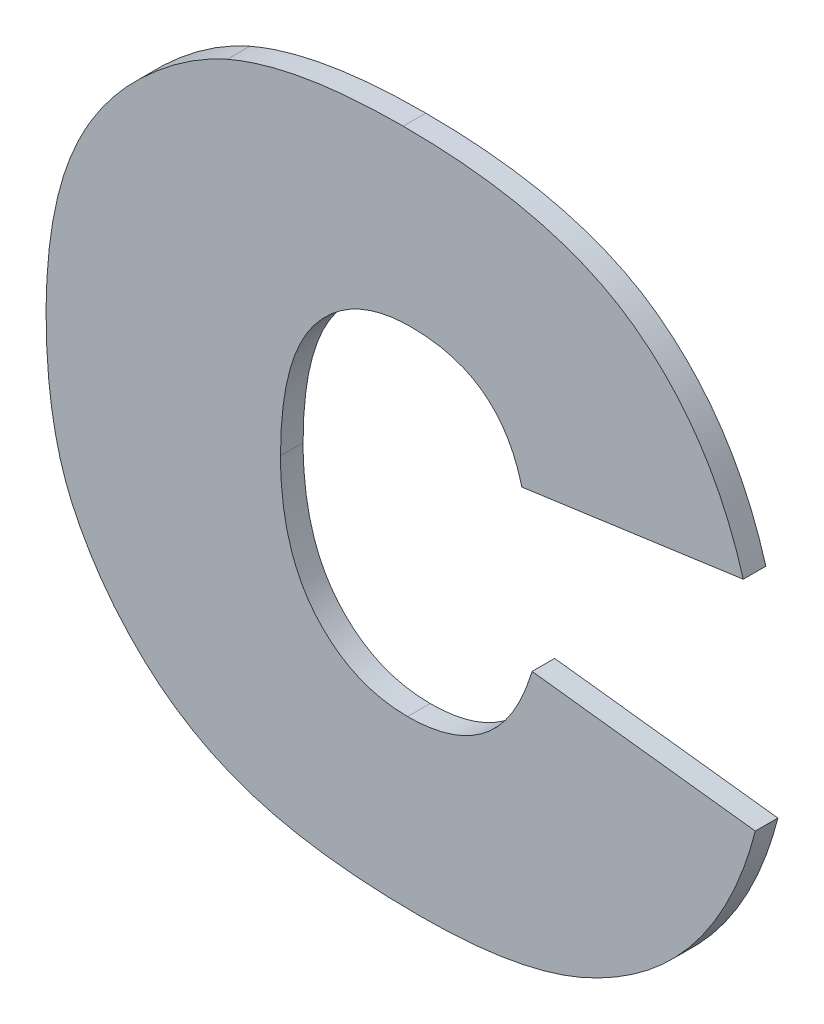
ISO-10303-21;
HEADER;
FILE_DESCRIPTION(('STEP AP214'),'2;1');
FILE_NAME('part.step','',(''),(''),'','','');
FILE_SCHEMA(('AUTOMOTIVE_DESIGN { 1 0 10303 214 1 1 1 1 }'));
ENDSEC;
DATA;
#1=APPLICATION_CONTEXT('core data for automotive mechanical design processes');
#2=APPLICATION_PROTOCOL_DEFINITION('international standard','automotive_design',2000,#1);
#3=PRODUCT_CONTEXT('',#1,'mechanical');
#4=PRODUCT('Part','Part','',(#3));
#5=PRODUCT_RELATED_PRODUCT_CATEGORY('part','',(#4));
#6=PRODUCT_DEFINITION_FORMATION('','',#4);
#7=PRODUCT_DEFINITION_CONTEXT('part definition',#1,'design');
#8=PRODUCT_DEFINITION('design','',#6,#7);
#9=PRODUCT_DEFINITION_SHAPE('','',#8);
#10=(LENGTH_UNIT() NAMED_UNIT(*) SI_UNIT(.MILLI.,.METRE.));
#11=(NAMED_UNIT(*) PLANE_ANGLE_UNIT() SI_UNIT($,.RADIAN.));
#12=(NAMED_UNIT(*) SI_UNIT($,.STERADIAN.) SOLID_ANGLE_UNIT());
#13=UNCERTAINTY_MEASURE_WITH_UNIT(LENGTH_MEASURE(1.E-05),#10,'distance_accuracy_value','');
#14=(GEOMETRIC_REPRESENTATION_CONTEXT(3) GLOBAL_UNCERTAINTY_ASSIGNED_CONTEXT((#13)) GLOBAL_UNIT_ASSIGNED_CONTEXT((#10,
#11,#12)) REPRESENTATION_CONTEXT('',''));
#15=CARTESIAN_POINT('',(0.,0.,0.));
#16=DIRECTION('',(0.,0.,1.));
#17=DIRECTION('',(1.,0.,0.));
#18=AXIS2_PLACEMENT_3D('',#15,#16,#17);
#19=CARTESIAN_POINT('',(1.0252863999862,-0.680804123163525,0.));
#20=CARTESIAN_POINT('',(1.0252863999862,-0.680804123163525,0.003));
#21=CARTESIAN_POINT('',(1.025286385339,-0.66893671234038,0.));
#22=CARTESIAN_POINT('',(1.025286385339,-0.66893671234038,0.003));
#23=CARTESIAN_POINT('',(1.0348715874076,-0.657297509125677,0.));
#24=CARTESIAN_POINT('',(1.0348715874076,-0.657297509125677,0.003));
#25=CARTESIAN_POINT('',(1.0426310773432,-0.657297520956087,0.));
#26=CARTESIAN_POINT('',(1.0426310773432,-0.657297520956087,0.003));
#27=B_SPLINE_SURFACE_WITH_KNOTS('',2,1,((#19,#20),(#21,#22),(#23,#24),(#25,#26)),.UNSPECIFIED.,
.F.,.F.,.F.,(3,1,3),(2,2),(-2.,-1.,0.),(0.,0.0003),.UNSPECIFIED.);
#28=CARTESIAN_POINT('',(1.0252863999862,-0.680804123163525,0.));
#29=CARTESIAN_POINT('',(1.025286385339,-0.66893671234038,0.));
#30=CARTESIAN_POINT('',(1.0348715874076,-0.657297509125677,0.));
#31=CARTESIAN_POINT('',(1.0426310773432,-0.657297520956087,0.));
#32=B_SPLINE_CURVE_WITH_KNOTS('',2,(#28,#29,#30,#31),.UNSPECIFIED.,.F.,.F.,(3,1,3),(-2.,-1.,0.),.UNSPECIFIED.);
#33=CARTESIAN_POINT('',(1.0252863999862,-0.680804123163525,0.));
#34=VERTEX_POINT('',#33);
#35=CARTESIAN_POINT('',(1.0426310773432,-0.657297520956087,0.));
#36=VERTEX_POINT('',#35);
#37=EDGE_CURVE('E11',#34,#36,#32,.T.);
#38=DIRECTION('',(0.,0.,1.));
#39=VECTOR('',#38,1.);
#40=CARTESIAN_POINT('',(1.0426310773432,-0.657297520956087,0.));
#41=LINE('',#40,#39);
#42=CARTESIAN_POINT('',(1.0426310773432,-0.657297520956087,0.003));
#43=VERTEX_POINT('',#42);
#44=EDGE_CURVE('E28',#36,#43,#41,.T.);
#45=CARTESIAN_POINT('',(1.0252863999862,-0.680804123163525,0.003));
#46=CARTESIAN_POINT('',(1.025286385339,-0.66893671234038,0.003));
#47=CARTESIAN_POINT('',(1.0348715874076,-0.657297509125677,0.003));
#48=CARTESIAN_POINT('',(1.0426310773432,-0.657297520956087,0.003));
#49=B_SPLINE_CURVE_WITH_KNOTS('',2,(#45,#46,#47,#48),.UNSPECIFIED.,.F.,.F.,(3,1,3),(-2.,-1.,0.),.UNSPECIFIED.);
#50=CARTESIAN_POINT('',(1.0252863999862,-0.680804123163525,0.003));
#51=VERTEX_POINT('',#50);
#52=EDGE_CURVE('E128',#51,#43,#49,.T.);
#53=DIRECTION('',(0.,0.,1.));
#54=VECTOR('',#53,1.);
#55=CARTESIAN_POINT('',(1.0252863999862,-0.680804123163525,0.));
#56=LINE('',#55,#54);
#57=EDGE_CURVE('E297',#34,#51,#56,.T.);
#58=ORIENTED_EDGE('',*,*,#37,.T.);
#59=ORIENTED_EDGE('',*,*,#44,.T.);
#60=ORIENTED_EDGE('',*,*,#52,.F.);
#61=ORIENTED_EDGE('',*,*,#57,.F.);
#62=EDGE_LOOP('',(#58,#59,#60,#61));
#63=FACE_BOUND('',#62,.T.);
#64=ADVANCED_FACE('F17',(#63),#27,.T.);
#65=CARTESIAN_POINT('',(1.0421746384654,-0.702370860140251,0.));
#66=CARTESIAN_POINT('',(1.0421746384654,-0.702370860140251,0.003));
#67=CARTESIAN_POINT('',(1.0347575067009,-0.702370873227862,0.));
#68=CARTESIAN_POINT('',(1.0347575067009,-0.702370873227862,0.003));
#69=CARTESIAN_POINT('',(1.0252863806569,-0.691416356872166,0.));
#70=CARTESIAN_POINT('',(1.0252863806569,-0.691416356872166,0.003));
#71=CARTESIAN_POINT('',(1.0252863999862,-0.680804123163525,0.));
#72=CARTESIAN_POINT('',(1.0252863999862,-0.680804123163525,0.003));
#73=B_SPLINE_SURFACE_WITH_KNOTS('',2,1,((#65,#66),(#67,#68),(#69,#70),(#71,#72)),.UNSPECIFIED.,
.F.,.F.,.F.,(3,1,3),(2,2),(-2.,-1.,0.),(0.,0.0003),.UNSPECIFIED.);
#74=CARTESIAN_POINT('',(1.0421746384654,-0.702370860140251,0.));
#75=CARTESIAN_POINT('',(1.0347575067009,-0.702370873227862,0.));
#76=CARTESIAN_POINT('',(1.0252863806569,-0.691416356872166,0.));
#77=CARTESIAN_POINT('',(1.0252863999862,-0.680804123163525,0.));
#78=B_SPLINE_CURVE_WITH_KNOTS('',2,(#74,#75,#76,#77),.UNSPECIFIED.,.F.,.F.,(3,1,3),(-2.,-1.,0.),.UNSPECIFIED.);
#79=CARTESIAN_POINT('',(1.0421746384654,-0.702370860140251,0.));
#80=VERTEX_POINT('',#79);
#81=EDGE_CURVE('E289',#80,#34,#78,.T.);
#82=CARTESIAN_POINT('',(1.0421746384654,-0.702370860140251,0.003));
#83=CARTESIAN_POINT('',(1.0347575067009,-0.702370873227862,0.003));
#84=CARTESIAN_POINT('',(1.0252863806569,-0.691416356872166,0.003));
#85=CARTESIAN_POINT('',(1.0252863999862,-0.680804123163525,0.003));
#86=B_SPLINE_CURVE_WITH_KNOTS('',2,(#82,#83,#84,#85),.UNSPECIFIED.,.F.,.F.,(3,1,3),(-2.,-1.,0.),.UNSPECIFIED.);
#87=CARTESIAN_POINT('',(1.0421746384654,-0.702370860140251,0.003));
#88=VERTEX_POINT('',#87);
#89=EDGE_CURVE('E285',#88,#51,#86,.T.);
#90=DIRECTION('',(0.,0.,1.));
#91=VECTOR('',#90,1.);
#92=CARTESIAN_POINT('',(1.0421746384654,-0.702370860140251,0.));
#93=LINE('',#92,#91);
#94=EDGE_CURVE('E279',#80,#88,#93,.T.);
#95=ORIENTED_EDGE('',*,*,#81,.T.);
#96=ORIENTED_EDGE('',*,*,#57,.T.);
#97=ORIENTED_EDGE('',*,*,#89,.F.);
#98=ORIENTED_EDGE('',*,*,#94,.F.);
#99=EDGE_LOOP('',(#95,#96,#97,#98));
#100=FACE_BOUND('',#99,.T.);
#101=ADVANCED_FACE('F334',(#100),#73,.T.);
#102=CARTESIAN_POINT('',(1.0587205477861,-0.688905913244729,0.));
#103=CARTESIAN_POINT('',(1.0587205477861,-0.688905913244729,0.003));
#104=CARTESIAN_POINT('',(1.0566665837524,-0.695752499686859,0.));
#105=CARTESIAN_POINT('',(1.0566665837524,-0.695752499686859,0.003));
#106=CARTESIAN_POINT('',(1.0483365847848,-0.702370876696698,0.));
#107=CARTESIAN_POINT('',(1.0483365847848,-0.702370876696698,0.003));
#108=CARTESIAN_POINT('',(1.0421746384654,-0.702370860140251,0.));
#109=CARTESIAN_POINT('',(1.0421746384654,-0.702370860140251,0.003));
#110=B_SPLINE_SURFACE_WITH_KNOTS('',2,1,((#102,#103),(#104,#105),(#106,#107),(#108,#109)),
.UNSPECIFIED.,.F.,.F.,.F.,(3,1,3),(2,2),(-2.,-1.,0.),(0.,0.0003),.UNSPECIFIED.);
#111=CARTESIAN_POINT('',(1.0587205477861,-0.688905913244729,0.));
#112=CARTESIAN_POINT('',(1.0566665837524,-0.695752499686859,0.));
#113=CARTESIAN_POINT('',(1.0483365847848,-0.702370876696698,0.));
#114=CARTESIAN_POINT('',(1.0421746384654,-0.702370860140251,0.));
#115=B_SPLINE_CURVE_WITH_KNOTS('',2,(#111,#112,#113,#114),.UNSPECIFIED.,.F.,.F.,(3,1,3),(-2.,
-1.,0.),.UNSPECIFIED.);
#116=CARTESIAN_POINT('',(1.0587205477861,-0.688905913244729,0.));
#117=VERTEX_POINT('',#116);
#118=EDGE_CURVE('E271',#117,#80,#115,.T.);
#119=CARTESIAN_POINT('',(1.0587205477861,-0.688905913244729,0.003));
#120=CARTESIAN_POINT('',(1.0566665837524,-0.695752499686859,0.003));
#121=CARTESIAN_POINT('',(1.0483365847848,-0.702370876696698,0.003));
#122=CARTESIAN_POINT('',(1.0421746384654,-0.702370860140251,0.003));
#123=B_SPLINE_CURVE_WITH_KNOTS('',2,(#119,#120,#121,#122),.UNSPECIFIED.,.F.,.F.,(3,1,3),(-2.,
-1.,0.),.UNSPECIFIED.);
#124=CARTESIAN_POINT('',(1.0587205477861,-0.688905913244729,0.003));
#125=VERTEX_POINT('',#124);
#126=EDGE_CURVE('E266',#125,#88,#123,.T.);
#127=DIRECTION('',(0.,0.,1.));
#128=VECTOR('',#127,1.);
#129=CARTESIAN_POINT('',(1.0587205477861,-0.688905913244729,0.));
#130=LINE('',#129,#128);
#131=EDGE_CURVE('E263',#117,#125,#130,.T.);
#132=ORIENTED_EDGE('',*,*,#118,.T.);
#133=ORIENTED_EDGE('',*,*,#94,.T.);
#134=ORIENTED_EDGE('',*,*,#126,.F.);
#135=ORIENTED_EDGE('',*,*,#131,.F.);
#136=EDGE_LOOP('',(#132,#133,#134,#135));
#137=FACE_BOUND('',#136,.T.);
#138=ADVANCED_FACE('F331',(#137),#110,.T.);
#139=CARTESIAN_POINT('',(1.0883890748441,-0.692443314547789,0.));
#140=DIRECTION('',(0.118392208536195,0.992966910303622,0.));
#141=DIRECTION('',(-0.992966910303622,0.118392208536195,0.));
#142=AXIS2_PLACEMENT_3D('',#139,#140,#141);
#143=PLANE('',#142);
#144=DIRECTION('',(-0.992966910303622,0.118392208536195,0.));
#145=VECTOR('',#144,1.);
#146=CARTESIAN_POINT('',(1.0883890748441,-0.692443314547789,0.));
#147=LINE('',#146,#145);
#148=CARTESIAN_POINT('',(1.0883890748441,-0.692443314547789,0.));
#149=VERTEX_POINT('',#148);
#150=EDGE_CURVE('E260',#149,#117,#147,.T.);
#151=ORIENTED_EDGE('',*,*,#150,.T.);
#152=ORIENTED_EDGE('',*,*,#131,.T.);
#153=DIRECTION('',(-0.992966910303622,0.118392208536195,0.));
#154=VECTOR('',#153,1.);
#155=CARTESIAN_POINT('',(1.0883890748441,-0.692443314547789,0.003));
#156=LINE('',#155,#154);
#157=CARTESIAN_POINT('',(1.0883890748441,-0.692443314547789,0.003));
#158=VERTEX_POINT('',#157);
#159=EDGE_CURVE('E257',#158,#125,#156,.T.);
#160=ORIENTED_EDGE('',*,*,#159,.F.);
#161=DIRECTION('',(0.,0.,1.));
#162=VECTOR('',#161,1.);
#163=CARTESIAN_POINT('',(1.0883890748441,-0.692443314547789,0.));
#164=LINE('',#163,#162);
#165=EDGE_CURVE('E251',#149,#158,#164,.T.);
#166=ORIENTED_EDGE('',*,*,#165,.F.);
#167=EDGE_LOOP('',(#151,#152,#160,#166));
#168=FACE_BOUND('',#167,.T.);
#169=ADVANCED_FACE('F328',(#168),#143,.T.);
#170=CARTESIAN_POINT('',(1.0438862842572,-0.724508145714247,0.));
#171=CARTESIAN_POINT('',(1.0438862842572,-0.724508145714247,0.003));
#172=CARTESIAN_POINT('',(1.0573512311527,-0.724508146115564,0.));
#173=CARTESIAN_POINT('',(1.0573512311527,-0.724508146115564,0.003));
#174=CARTESIAN_POINT('',(1.0746959087477,-0.716520466270696,0.));
#175=CARTESIAN_POINT('',(1.0746959087477,-0.716520466270696,0.003));
#176=CARTESIAN_POINT('',(1.0858786616793,-0.702256751672319,0.));
#177=CARTESIAN_POINT('',(1.0858786616793,-0.702256751672319,0.003));
#178=CARTESIAN_POINT('',(1.0883890748441,-0.692443314547789,0.));
#179=CARTESIAN_POINT('',(1.0883890748441,-0.692443314547789,0.003));
#180=B_SPLINE_SURFACE_WITH_KNOTS('',2,1,((#170,#171),(#172,#173),(#174,#175),(#176,#177),(#178,
#179)),.UNSPECIFIED.,.F.,.F.,.F.,(3,1,1,3),(2,2),(-3.,-2.,-1.,0.),(0.,0.0003),.UNSPECIFIED.);
#181=CARTESIAN_POINT('',(1.0438862842572,-0.724508145714247,0.));
#182=CARTESIAN_POINT('',(1.0573512311527,-0.724508146115564,0.));
#183=CARTESIAN_POINT('',(1.0746959087477,-0.716520466270696,0.));
#184=CARTESIAN_POINT('',(1.0858786616793,-0.702256751672319,0.));
#185=CARTESIAN_POINT('',(1.0883890748441,-0.692443314547789,0.));
#186=B_SPLINE_CURVE_WITH_KNOTS('',2,(#181,#182,#183,#184,#185),.UNSPECIFIED.,.F.,.F.,(3,1,1,3),
(-3.,-2.,-1.,0.),.UNSPECIFIED.);
#187=CARTESIAN_POINT('',(1.0438862842572,-0.724508145714247,0.));
#188=VERTEX_POINT('',#187);
#189=EDGE_CURVE('E243',#188,#149,#186,.T.);
#190=CARTESIAN_POINT('',(1.0438862842572,-0.724508145714247,0.003));
#191=CARTESIAN_POINT('',(1.0573512311527,-0.724508146115564,0.003));
#192=CARTESIAN_POINT('',(1.0746959087477,-0.716520466270696,0.003));
#193=CARTESIAN_POINT('',(1.0858786616793,-0.702256751672319,0.003));
#194=CARTESIAN_POINT('',(1.0883890748441,-0.692443314547789,0.003));
#195=B_SPLINE_CURVE_WITH_KNOTS('',2,(#190,#191,#192,#193,#194),.UNSPECIFIED.,.F.,.F.,(3,1,1,3),
(-3.,-2.,-1.,0.),.UNSPECIFIED.);
#196=CARTESIAN_POINT('',(1.0438862842572,-0.724508145714247,0.003));
#197=VERTEX_POINT('',#196);
#198=EDGE_CURVE('E238',#197,#158,#195,.T.);
#199=DIRECTION('',(0.,0.,1.));
#200=VECTOR('',#199,1.);
#201=CARTESIAN_POINT('',(1.0438862842572,-0.724508145714247,0.));
#202=LINE('',#201,#200);
#203=EDGE_CURVE('E232',#188,#197,#202,.T.);
#204=ORIENTED_EDGE('',*,*,#189,.T.);
#205=ORIENTED_EDGE('',*,*,#165,.T.);
#206=ORIENTED_EDGE('',*,*,#198,.F.);
#207=ORIENTED_EDGE('',*,*,#203,.F.);
#208=EDGE_LOOP('',(#204,#205,#206,#207));
#209=FACE_BOUND('',#208,.T.);
#210=ADVANCED_FACE('F325',(#209),#180,.T.);
#211=CARTESIAN_POINT('',(0.994134446575399,-0.680005355127352,0.));
#212=CARTESIAN_POINT('',(0.994134446575399,-0.680005355127352,0.003));
#213=CARTESIAN_POINT('',(0.994134458500729,-0.692671533986725,0.));
#214=CARTESIAN_POINT('',(0.994134458500729,-0.692671533986725,0.003));
#215=CARTESIAN_POINT('',(1.0012092755033,-0.707962229732479,0.));
#216=CARTESIAN_POINT('',(1.0012092755033,-0.707962229732479,0.003));
#217=CARTESIAN_POINT('',(1.0136472456672,-0.719373189967319,0.));
#218=CARTESIAN_POINT('',(1.0136472456672,-0.719373189967319,0.003));
#219=CARTESIAN_POINT('',(1.0308778181392,-0.724508111119978,0.));
#220=CARTESIAN_POINT('',(1.0308778181392,-0.724508111119978,0.003));
#221=CARTESIAN_POINT('',(1.0438862842572,-0.724508145714247,0.));
#222=CARTESIAN_POINT('',(1.0438862842572,-0.724508145714247,0.003));
#223=B_SPLINE_SURFACE_WITH_KNOTS('',2,1,((#211,#212),(#213,#214),(#215,#216),(#217,#218),(#219,
#220),(#221,#222)),.UNSPECIFIED.,.F.,.F.,.F.,(3,1,1,1,3),(2,2),(-4.,-3.,-2.,-1.,0.),(0.,0.0003),.UNSPECIFIED.);
#224=CARTESIAN_POINT('',(0.994134446575399,-0.680005355127352,0.));
#225=CARTESIAN_POINT('',(0.994134458500729,-0.692671533986725,0.));
#226=CARTESIAN_POINT('',(1.0012092755033,-0.707962229732479,0.));
#227=CARTESIAN_POINT('',(1.0136472456672,-0.719373189967319,0.));
#228=CARTESIAN_POINT('',(1.0308778181392,-0.724508111119978,0.));
#229=CARTESIAN_POINT('',(1.0438862842572,-0.724508145714247,0.));
#230=B_SPLINE_CURVE_WITH_KNOTS('',2,(#224,#225,#226,#227,#228,#229),.UNSPECIFIED.,.F.,.F.,(3,1,
1,1,3),(-4.,-3.,-2.,-1.,0.),.UNSPECIFIED.);
#231=CARTESIAN_POINT('',(0.994134446575399,-0.680005355127352,0.));
#232=VERTEX_POINT('',#231);
#233=EDGE_CURVE('E224',#232,#188,#230,.T.);
#234=CARTESIAN_POINT('',(0.994134446575399,-0.680005355127352,0.003));
#235=CARTESIAN_POINT('',(0.994134458500729,-0.692671533986725,0.003));
#236=CARTESIAN_POINT('',(1.0012092755033,-0.707962229732479,0.003));
#237=CARTESIAN_POINT('',(1.0136472456672,-0.719373189967319,0.003));
#238=CARTESIAN_POINT('',(1.0308778181392,-0.724508111119978,0.003));
#239=CARTESIAN_POINT('',(1.0438862842572,-0.724508145714247,0.003));
#240=B_SPLINE_CURVE_WITH_KNOTS('',2,(#234,#235,#236,#237,#238,#239),.UNSPECIFIED.,.F.,.F.,(3,1,
1,1,3),(-4.,-3.,-2.,-1.,0.),.UNSPECIFIED.);
#241=CARTESIAN_POINT('',(0.994134446575399,-0.680005355127352,0.003));
#242=VERTEX_POINT('',#241);
#243=EDGE_CURVE('E219',#242,#197,#240,.T.);
#244=DIRECTION('',(0.,0.,1.));
#245=VECTOR('',#244,1.);
#246=CARTESIAN_POINT('',(0.994134446575399,-0.680005355127352,0.));
#247=LINE('',#246,#245);
#248=EDGE_CURVE('E213',#232,#242,#247,.T.);
#249=ORIENTED_EDGE('',*,*,#233,.T.);
#250=ORIENTED_EDGE('',*,*,#203,.T.);
#251=ORIENTED_EDGE('',*,*,#243,.F.);
#252=ORIENTED_EDGE('',*,*,#248,.F.);
#253=EDGE_LOOP('',(#249,#250,#251,#252));
#254=FACE_BOUND('',#253,.T.);
#255=ADVANCED_FACE('F322',(#254),#223,.T.);
#256=CARTESIAN_POINT('',(0.998470615914639,-0.657868069553356,0.));
#257=CARTESIAN_POINT('',(0.998470615914639,-0.657868069553356,0.003));
#258=CARTESIAN_POINT('',(0.994134458887119,-0.666768633668753,0.));
#259=CARTESIAN_POINT('',(0.994134458887119,-0.666768633668753,0.003));
#260=CARTESIAN_POINT('',(0.994134446575399,-0.680005355127352,0.));
#261=CARTESIAN_POINT('',(0.994134446575399,-0.680005355127352,0.003));
#262=B_SPLINE_SURFACE_WITH_KNOTS('',2,1,((#256,#257),(#258,#259),(#260,#261)),.UNSPECIFIED.,.F.,
.F.,.F.,(3,3),(2,2),(-1.,0.),(0.,0.0003),.UNSPECIFIED.);
#263=CARTESIAN_POINT('',(0.998470615914639,-0.657868069553356,0.));
#264=CARTESIAN_POINT('',(0.994134458887119,-0.666768633668753,0.));
#265=CARTESIAN_POINT('',(0.994134446575399,-0.680005355127352,0.));
#266=B_SPLINE_CURVE_WITH_KNOTS('',2,(#263,#264,#265),.UNSPECIFIED.,.F.,.F.,(3,3),(-1.,0.),.UNSPECIFIED.);
#267=CARTESIAN_POINT('',(0.998470615914639,-0.657868069553356,0.));
#268=VERTEX_POINT('',#267);
#269=EDGE_CURVE('E205',#268,#232,#266,.T.);
#270=CARTESIAN_POINT('',(0.998470615914639,-0.657868069553356,0.003));
#271=CARTESIAN_POINT('',(0.994134458887119,-0.666768633668753,0.003));
#272=CARTESIAN_POINT('',(0.994134446575399,-0.680005355127352,0.003));
#273=B_SPLINE_CURVE_WITH_KNOTS('',2,(#270,#271,#272),.UNSPECIFIED.,.F.,.F.,(3,3),(-1.,0.),.UNSPECIFIED.);
#274=CARTESIAN_POINT('',(0.998470615914639,-0.657868069553356,0.003));
#275=VERTEX_POINT('',#274);
#276=EDGE_CURVE('E200',#275,#242,#273,.T.);
#277=DIRECTION('',(0.,0.,1.));
#278=VECTOR('',#277,1.);
#279=CARTESIAN_POINT('',(0.998470615914639,-0.657868069553356,0.));
#280=LINE('',#279,#278);
#281=EDGE_CURVE('E194',#268,#275,#280,.T.);
#282=ORIENTED_EDGE('',*,*,#269,.T.);
#283=ORIENTED_EDGE('',*,*,#248,.T.);
#284=ORIENTED_EDGE('',*,*,#276,.F.);
#285=ORIENTED_EDGE('',*,*,#281,.F.);
#286=EDGE_LOOP('',(#282,#283,#284,#285));
#287=FACE_BOUND('',#286,.T.);
#288=ADVANCED_FACE('F319',(#287),#262,.T.);
#289=CARTESIAN_POINT('',(1.0182115973801,-0.638697636685158,0.));
#290=CARTESIAN_POINT('',(1.0182115973801,-0.638697636685158,0.003));
#291=CARTESIAN_POINT('',(1.0125061144001,-0.641208057314605,0.));
#292=CARTESIAN_POINT('',(1.0125061144001,-0.641208057314605,0.003));
#293=CARTESIAN_POINT('',(1.0015515935752,-0.651477945124216,0.));
#294=CARTESIAN_POINT('',(1.0015515935752,-0.651477945124216,0.003));
#295=CARTESIAN_POINT('',(0.998470615914639,-0.657868069553356,0.));
#296=CARTESIAN_POINT('',(0.998470615914639,-0.657868069553356,0.003));
#297=B_SPLINE_SURFACE_WITH_KNOTS('',2,1,((#289,#290),(#291,#292),(#293,#294),(#295,#296)),
.UNSPECIFIED.,.F.,.F.,.F.,(3,1,3),(2,2),(-2.,-1.,0.),(0.,0.0003),.UNSPECIFIED.);
#298=CARTESIAN_POINT('',(1.0182115973801,-0.638697636685158,0.));
#299=CARTESIAN_POINT('',(1.0125061144001,-0.641208057314605,0.));
#300=CARTESIAN_POINT('',(1.0015515935752,-0.651477945124216,0.));
#301=CARTESIAN_POINT('',(0.998470615914639,-0.657868069553356,0.));
#302=B_SPLINE_CURVE_WITH_KNOTS('',2,(#298,#299,#300,#301),.UNSPECIFIED.,.F.,.F.,(3,1,3),(-2.,
-1.,0.),.UNSPECIFIED.);
#303=CARTESIAN_POINT('',(1.0182115973801,-0.638697636685158,0.));
#304=VERTEX_POINT('',#303);
#305=EDGE_CURVE('E186',#304,#268,#302,.T.);
#306=CARTESIAN_POINT('',(1.0182115973801,-0.638697636685158,0.003));
#307=CARTESIAN_POINT('',(1.0125061144001,-0.641208057314605,0.003));
#308=CARTESIAN_POINT('',(1.0015515935752,-0.651477945124216,0.003));
#309=CARTESIAN_POINT('',(0.998470615914639,-0.657868069553356,0.003));
#310=B_SPLINE_CURVE_WITH_KNOTS('',2,(#306,#307,#308,#309),.UNSPECIFIED.,.F.,.F.,(3,1,3),(-2.,
-1.,0.),.UNSPECIFIED.);
#311=CARTESIAN_POINT('',(1.0182115973801,-0.638697636685158,0.003));
#312=VERTEX_POINT('',#311);
#313=EDGE_CURVE('E181',#312,#275,#310,.T.);
#314=DIRECTION('',(0.,0.,1.));
#315=VECTOR('',#314,1.);
#316=CARTESIAN_POINT('',(1.0182115973801,-0.638697636685158,0.));
#317=LINE('',#316,#315);
#318=EDGE_CURVE('E175',#304,#312,#317,.T.);
#319=ORIENTED_EDGE('',*,*,#305,.T.);
#320=ORIENTED_EDGE('',*,*,#281,.T.);
#321=ORIENTED_EDGE('',*,*,#313,.F.);
#322=ORIENTED_EDGE('',*,*,#318,.F.);
#323=EDGE_LOOP('',(#319,#320,#321,#322));
#324=FACE_BOUND('',#323,.T.);
#325=ADVANCED_FACE('F316',(#324),#297,.T.);
#326=CARTESIAN_POINT('',(1.0416040898681,-0.634703796504277,0.));
#327=CARTESIAN_POINT('',(1.0416040898681,-0.634703796504277,0.003));
#328=CARTESIAN_POINT('',(1.0273403749364,-0.634703797442519,0.));
#329=CARTESIAN_POINT('',(1.0273403749364,-0.634703797442519,0.003));
#330=CARTESIAN_POINT('',(1.0182115973801,-0.638697636685158,0.));
#331=CARTESIAN_POINT('',(1.0182115973801,-0.638697636685158,0.003));
#332=B_SPLINE_SURFACE_WITH_KNOTS('',2,1,((#326,#327),(#328,#329),(#330,#331)),.UNSPECIFIED.,.F.,
.F.,.F.,(3,3),(2,2),(-1.,0.),(0.,0.0003),.UNSPECIFIED.);
#333=CARTESIAN_POINT('',(1.0416040898681,-0.634703796504277,0.));
#334=CARTESIAN_POINT('',(1.0273403749364,-0.634703797442519,0.));
#335=CARTESIAN_POINT('',(1.0182115973801,-0.638697636685158,0.));
#336=B_SPLINE_CURVE_WITH_KNOTS('',2,(#333,#334,#335),.UNSPECIFIED.,.F.,.F.,(3,3),(-1.,0.),.UNSPECIFIED.);
#337=CARTESIAN_POINT('',(1.0416040898681,-0.634703796504277,0.));
#338=VERTEX_POINT('',#337);
#339=EDGE_CURVE('E167',#338,#304,#336,.T.);
#340=CARTESIAN_POINT('',(1.0416040898681,-0.634703796504277,0.003));
#341=CARTESIAN_POINT('',(1.0273403749364,-0.634703797442519,0.003));
#342=CARTESIAN_POINT('',(1.0182115973801,-0.638697636685158,0.003));
#343=B_SPLINE_CURVE_WITH_KNOTS('',2,(#340,#341,#342),.UNSPECIFIED.,.F.,.F.,(3,3),(-1.,0.),.UNSPECIFIED.);
#344=CARTESIAN_POINT('',(1.0416040898681,-0.634703796504277,0.003));
#345=VERTEX_POINT('',#344);
#346=EDGE_CURVE('E162',#345,#312,#343,.T.);
#347=DIRECTION('',(0.,0.,1.));
#348=VECTOR('',#347,1.);
#349=CARTESIAN_POINT('',(1.0416040898681,-0.634703796504277,0.));
#350=LINE('',#349,#348);
#351=EDGE_CURVE('E156',#338,#345,#350,.T.);
#352=ORIENTED_EDGE('',*,*,#339,.T.);
#353=ORIENTED_EDGE('',*,*,#318,.T.);
#354=ORIENTED_EDGE('',*,*,#346,.F.);
#355=ORIENTED_EDGE('',*,*,#351,.F.);
#356=EDGE_LOOP('',(#352,#353,#354,#355));
#357=FACE_BOUND('',#356,.T.);
#358=ADVANCED_FACE('F313',(#357),#332,.T.);
#359=CARTESIAN_POINT('',(1.0867915387717,-0.664258213842758,0.));
#360=CARTESIAN_POINT('',(1.0867915387717,-0.664258213842758,0.003));
#361=CARTESIAN_POINT('',(1.0825694562616,-0.649766286141009,0.));
#362=CARTESIAN_POINT('',(1.0825694562616,-0.649766286141009,0.003));
#363=CARTESIAN_POINT('',(1.0615732440906,-0.634703836337102,0.));
#364=CARTESIAN_POINT('',(1.0615732440906,-0.634703836337102,0.003));
#365=CARTESIAN_POINT('',(1.0416040898681,-0.634703796504277,0.));
#366=CARTESIAN_POINT('',(1.0416040898681,-0.634703796504277,0.003));
#367=B_SPLINE_SURFACE_WITH_KNOTS('',2,1,((#359,#360),(#361,#362),(#363,#364),(#365,#366)),
.UNSPECIFIED.,.F.,.F.,.F.,(3,1,3),(2,2),(-2.,-1.,0.),(0.,0.0003),.UNSPECIFIED.);
#368=CARTESIAN_POINT('',(1.0867915387717,-0.664258213842758,0.));
#369=CARTESIAN_POINT('',(1.0825694562616,-0.649766286141009,0.));
#370=CARTESIAN_POINT('',(1.0615732440906,-0.634703836337102,0.));
#371=CARTESIAN_POINT('',(1.0416040898681,-0.634703796504277,0.));
#372=B_SPLINE_CURVE_WITH_KNOTS('',2,(#368,#369,#370,#371),.UNSPECIFIED.,.F.,.F.,(3,1,3),(-2.,
-1.,0.),.UNSPECIFIED.);
#373=CARTESIAN_POINT('',(1.0867915387717,-0.664258213842758,0.));
#374=VERTEX_POINT('',#373);
#375=EDGE_CURVE('E148',#374,#338,#372,.T.);
#376=CARTESIAN_POINT('',(1.0867915387717,-0.664258213842758,0.003));
#377=CARTESIAN_POINT('',(1.0825694562616,-0.649766286141009,0.003));
#378=CARTESIAN_POINT('',(1.0615732440906,-0.634703836337102,0.003));
#379=CARTESIAN_POINT('',(1.0416040898681,-0.634703796504277,0.003));
#380=B_SPLINE_CURVE_WITH_KNOTS('',2,(#376,#377,#378,#379),.UNSPECIFIED.,.F.,.F.,(3,1,3),(-2.,
-1.,0.),.UNSPECIFIED.);
#381=CARTESIAN_POINT('',(1.0867915387717,-0.664258213842758,0.003));
#382=VERTEX_POINT('',#381);
#383=EDGE_CURVE('E144',#382,#345,#380,.T.);
#384=DIRECTION('',(0.,0.,1.));
#385=VECTOR('',#384,1.);
#386=CARTESIAN_POINT('',(1.0867915387717,-0.664258213842758,0.));
#387=LINE('',#386,#385);
#388=EDGE_CURVE('E113',#374,#382,#387,.T.);
#389=ORIENTED_EDGE('',*,*,#375,.T.);
#390=ORIENTED_EDGE('',*,*,#351,.T.);
#391=ORIENTED_EDGE('',*,*,#383,.F.);
#392=ORIENTED_EDGE('',*,*,#388,.F.);
#393=EDGE_LOOP('',(#389,#390,#391,#392));
#394=FACE_BOUND('',#393,.T.);
#395=ADVANCED_FACE('F311',(#394),#367,.T.);
#396=CARTESIAN_POINT('',(1.0573512311527,-0.668366163743088,0.));
#397=DIRECTION('',(0.138196031911508,-0.990404895365483,0.));
#398=DIRECTION('',(0.990404895365483,0.138196031911508,0.));
#399=AXIS2_PLACEMENT_3D('',#396,#397,#398);
#400=PLANE('',#399);
#401=DIRECTION('',(0.990404895365483,0.138196031911508,0.));
#402=VECTOR('',#401,1.);
#403=CARTESIAN_POINT('',(1.0573512311527,-0.668366163743088,0.));
#404=LINE('',#403,#402);
#405=CARTESIAN_POINT('',(1.0573512311527,-0.668366163743088,0.));
#406=VERTEX_POINT('',#405);
#407=EDGE_CURVE('E117',#406,#374,#404,.T.);
#408=ORIENTED_EDGE('',*,*,#407,.T.);
#409=ORIENTED_EDGE('',*,*,#388,.T.);
#410=DIRECTION('',(0.990404895365483,0.138196031911508,0.));
#411=VECTOR('',#410,1.);
#412=CARTESIAN_POINT('',(1.0573512311527,-0.668366163743088,0.003));
#413=LINE('',#412,#411);
#414=CARTESIAN_POINT('',(1.0573512311527,-0.668366163743088,0.003));
#415=VERTEX_POINT('',#414);
#416=EDGE_CURVE('E106',#415,#382,#413,.T.);
#417=ORIENTED_EDGE('',*,*,#416,.F.);
#418=DIRECTION('',(0.,0.,1.));
#419=VECTOR('',#418,1.);
#420=CARTESIAN_POINT('',(1.0573512311527,-0.668366163743088,0.));
#421=LINE('',#420,#419);
#422=EDGE_CURVE('E110',#406,#415,#421,.T.);
#423=ORIENTED_EDGE('',*,*,#422,.F.);
#424=EDGE_LOOP('',(#408,#409,#417,#423));
#425=FACE_BOUND('',#424,.T.);
#426=ADVANCED_FACE('F109',(#425),#400,.T.);
#427=CARTESIAN_POINT('',(1.0426310773432,-0.657297520956087,0.));
#428=CARTESIAN_POINT('',(1.0426310773432,-0.657297520956087,0.003));
#429=CARTESIAN_POINT('',(1.0486788924741,-0.657297499237128,0.));
#430=CARTESIAN_POINT('',(1.0486788924741,-0.657297499237128,0.003));
#431=CARTESIAN_POINT('',(1.055981934599,-0.66288884926358,0.));
#432=CARTESIAN_POINT('',(1.055981934599,-0.66288884926358,0.003));
#433=CARTESIAN_POINT('',(1.0573512311527,-0.668366163743088,0.));
#434=CARTESIAN_POINT('',(1.0573512311527,-0.668366163743088,0.003));
#435=B_SPLINE_SURFACE_WITH_KNOTS('',2,1,((#427,#428),(#429,#430),(#431,#432),(#433,#434)),
.UNSPECIFIED.,.F.,.F.,.F.,(3,1,3),(2,2),(-2.,-1.,0.),(0.,0.0003),.UNSPECIFIED.);
#436=CARTESIAN_POINT('',(1.0426310773432,-0.657297520956087,0.));
#437=CARTESIAN_POINT('',(1.0486788924741,-0.657297499237128,0.));
#438=CARTESIAN_POINT('',(1.055981934599,-0.66288884926358,0.));
#439=CARTESIAN_POINT('',(1.0573512311527,-0.668366163743088,0.));
#440=B_SPLINE_CURVE_WITH_KNOTS('',2,(#436,#437,#438,#439),.UNSPECIFIED.,.F.,.F.,(3,1,3),(-2.,
-1.,0.),.UNSPECIFIED.);
#441=EDGE_CURVE('E123',#36,#406,#440,.T.);
#442=CARTESIAN_POINT('',(1.0426310773432,-0.657297520956087,0.003));
#443=CARTESIAN_POINT('',(1.0486788924741,-0.657297499237128,0.003));
#444=CARTESIAN_POINT('',(1.055981934599,-0.66288884926358,0.003));
#445=CARTESIAN_POINT('',(1.0573512311527,-0.668366163743088,0.003));
#446=B_SPLINE_CURVE_WITH_KNOTS('',2,(#442,#443,#444,#445),.UNSPECIFIED.,.F.,.F.,(3,1,3),(-2.,
-1.,0.),.UNSPECIFIED.);
#447=EDGE_CURVE('E122',#43,#415,#446,.T.);
#448=ORIENTED_EDGE('',*,*,#441,.T.);
#449=ORIENTED_EDGE('',*,*,#422,.T.);
#450=ORIENTED_EDGE('',*,*,#447,.F.);
#451=ORIENTED_EDGE('',*,*,#44,.F.);
#452=EDGE_LOOP('',(#448,#449,#450,#451));
#453=FACE_BOUND('',#452,.T.);
#454=ADVANCED_FACE('F121',(#453),#435,.T.);
#455=CARTESIAN_POINT('',(1.0412617607097,-0.67960597130992,0.003));
#456=DIRECTION('',(0.,0.,1.));
#457=DIRECTION('',(1.,0.,0.));
#458=AXIS2_PLACEMENT_3D('',#455,#456,#457);
#459=PLANE('',#458);
#460=ORIENTED_EDGE('',*,*,#447,.T.);
#461=ORIENTED_EDGE('',*,*,#416,.T.);
#462=ORIENTED_EDGE('',*,*,#383,.T.);
#463=ORIENTED_EDGE('',*,*,#346,.T.);
#464=ORIENTED_EDGE('',*,*,#313,.T.);
#465=ORIENTED_EDGE('',*,*,#276,.T.);
#466=ORIENTED_EDGE('',*,*,#243,.T.);
#467=ORIENTED_EDGE('',*,*,#198,.T.);
#468=ORIENTED_EDGE('',*,*,#159,.T.);
#469=ORIENTED_EDGE('',*,*,#126,.T.);
#470=ORIENTED_EDGE('',*,*,#89,.T.);
#471=ORIENTED_EDGE('',*,*,#52,.T.);
#472=EDGE_LOOP('',(#460,#461,#462,#463,#464,#465,#466,#467,#468,#469,#470,#471));
#473=FACE_BOUND('',#472,.T.);
#474=ADVANCED_FACE('F126',(#473),#459,.T.);
#475=CARTESIAN_POINT('',(1.0412617607097,-0.67960597130992,0.));
#476=DIRECTION('',(0.,0.,1.));
#477=DIRECTION('',(1.,0.,0.));
#478=AXIS2_PLACEMENT_3D('',#475,#476,#477);
#479=PLANE('',#478);
#480=ORIENTED_EDGE('',*,*,#441,.F.);
#481=ORIENTED_EDGE('',*,*,#37,.F.);
#482=ORIENTED_EDGE('',*,*,#81,.F.);
#483=ORIENTED_EDGE('',*,*,#118,.F.);
#484=ORIENTED_EDGE('',*,*,#150,.F.);
#485=ORIENTED_EDGE('',*,*,#189,.F.);
#486=ORIENTED_EDGE('',*,*,#233,.F.);
#487=ORIENTED_EDGE('',*,*,#269,.F.);
#488=ORIENTED_EDGE('',*,*,#305,.F.);
#489=ORIENTED_EDGE('',*,*,#339,.F.);
#490=ORIENTED_EDGE('',*,*,#375,.F.);
#491=ORIENTED_EDGE('',*,*,#407,.F.);
#492=EDGE_LOOP('',(#480,#481,#482,#483,#484,#485,#486,#487,#488,#489,#490,#491));
#493=FACE_BOUND('',#492,.T.);
#494=ADVANCED_FACE('F308',(#493),#479,.F.);
#495=CLOSED_SHELL('',(#64,#101,#138,#169,#210,#255,#288,#325,#358,#395,#426,#454,#474,#494));
#496=MANIFOLD_SOLID_BREP('B1',#495);
#497=ADVANCED_BREP_SHAPE_REPRESENTATION('',(#18,#496),#14);
#498=SHAPE_DEFINITION_REPRESENTATION(#9,#497);
ENDSEC;
END-ISO-10303-21;
